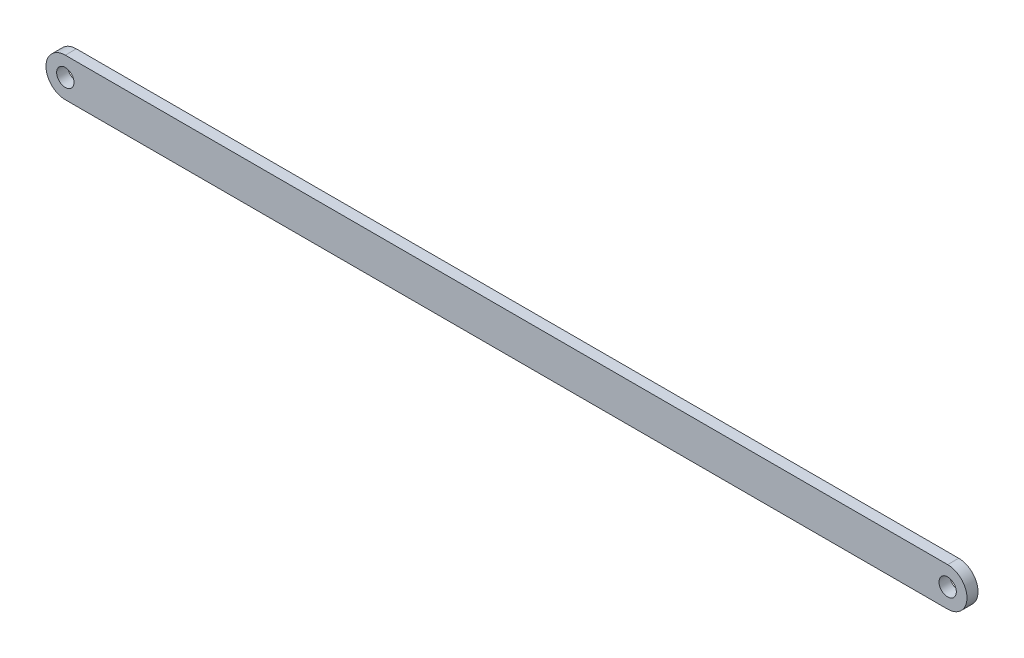
ISO-10303-21;
HEADER;
FILE_DESCRIPTION(('STEP AP214'),'2;1');
FILE_NAME('part.step','',(''),(''),'','','');
FILE_SCHEMA(('AUTOMOTIVE_DESIGN { 1 0 10303 214 1 1 1 1 }'));
ENDSEC;
DATA;
#1=APPLICATION_CONTEXT('core data for automotive mechanical design processes');
#2=APPLICATION_PROTOCOL_DEFINITION('international standard','automotive_design',2000,#1);
#3=PRODUCT_CONTEXT('',#1,'mechanical');
#4=PRODUCT('Part','Part','',(#3));
#5=PRODUCT_RELATED_PRODUCT_CATEGORY('part','',(#4));
#6=PRODUCT_DEFINITION_FORMATION('','',#4);
#7=PRODUCT_DEFINITION_CONTEXT('part definition',#1,'design');
#8=PRODUCT_DEFINITION('design','',#6,#7);
#9=PRODUCT_DEFINITION_SHAPE('','',#8);
#10=(LENGTH_UNIT() NAMED_UNIT(*) SI_UNIT(.MILLI.,.METRE.));
#11=(NAMED_UNIT(*) PLANE_ANGLE_UNIT() SI_UNIT($,.RADIAN.));
#12=(NAMED_UNIT(*) SI_UNIT($,.STERADIAN.) SOLID_ANGLE_UNIT());
#13=UNCERTAINTY_MEASURE_WITH_UNIT(LENGTH_MEASURE(1.E-05),#10,'distance_accuracy_value','');
#14=(GEOMETRIC_REPRESENTATION_CONTEXT(3) GLOBAL_UNCERTAINTY_ASSIGNED_CONTEXT((#13)) GLOBAL_UNIT_ASSIGNED_CONTEXT((#10,
#11,#12)) REPRESENTATION_CONTEXT('',''));
#15=CARTESIAN_POINT('',(0.,0.,0.));
#16=DIRECTION('',(0.,0.,1.));
#17=DIRECTION('',(1.,0.,0.));
#18=AXIS2_PLACEMENT_3D('',#15,#16,#17);
#19=CARTESIAN_POINT('',(-101.6,0.,2.54));
#20=DIRECTION('',(0.,0.,-1.));
#21=DIRECTION('',(-1.,0.,0.));
#22=AXIS2_PLACEMENT_3D('',#19,#20,#21);
#23=CYLINDRICAL_SURFACE('',#22,4.445);
#24=CARTESIAN_POINT('',(-101.6,0.,0.));
#25=DIRECTION('',(0.,0.,1.));
#26=DIRECTION('',(1.,0.,0.));
#27=AXIS2_PLACEMENT_3D('',#24,#25,#26);
#28=CIRCLE('',#27,4.445);
#29=CARTESIAN_POINT('',(-101.6,4.445,0.));
#30=VERTEX_POINT('',#29);
#31=CARTESIAN_POINT('',(-101.6,-4.445,0.));
#32=VERTEX_POINT('',#31);
#33=EDGE_CURVE('E109',#30,#32,#28,.T.);
#34=ORIENTED_EDGE('',*,*,#33,.T.);
#35=DIRECTION('',(0.,0.,-1.));
#36=VECTOR('',#35,1.);
#37=CARTESIAN_POINT('',(-101.6,-4.445,2.54));
#38=LINE('',#37,#36);
#39=CARTESIAN_POINT('',(-101.6,-4.445,2.54));
#40=VERTEX_POINT('',#39);
#41=EDGE_CURVE('E11',#40,#32,#38,.T.);
#42=ORIENTED_EDGE('',*,*,#41,.F.);
#43=CARTESIAN_POINT('',(-101.6,0.,2.54));
#44=DIRECTION('',(0.,0.,1.));
#45=DIRECTION('',(1.,0.,0.));
#46=AXIS2_PLACEMENT_3D('',#43,#44,#45);
#47=CIRCLE('',#46,4.445);
#48=CARTESIAN_POINT('',(-101.6,4.445,2.54));
#49=VERTEX_POINT('',#48);
#50=EDGE_CURVE('E89',#49,#40,#47,.T.);
#51=ORIENTED_EDGE('',*,*,#50,.F.);
#52=DIRECTION('',(0.,0.,-1.));
#53=VECTOR('',#52,1.);
#54=CARTESIAN_POINT('',(-101.6,4.445,2.54));
#55=LINE('',#54,#53);
#56=EDGE_CURVE('E55',#49,#30,#55,.T.);
#57=ORIENTED_EDGE('',*,*,#56,.T.);
#58=EDGE_LOOP('',(#34,#42,#51,#57));
#59=FACE_BOUND('',#58,.T.);
#60=ADVANCED_FACE('F38',(#59),#23,.T.);
#61=CARTESIAN_POINT('',(0.,-4.445,2.54));
#62=DIRECTION('',(0.,1.,0.));
#63=DIRECTION('',(0.,0.,1.));
#64=AXIS2_PLACEMENT_3D('',#61,#62,#63);
#65=PLANE('',#64);
#66=DIRECTION('',(1.,0.,0.));
#67=VECTOR('',#66,1.);
#68=CARTESIAN_POINT('',(0.,-4.445,0.));
#69=LINE('',#68,#67);
#70=CARTESIAN_POINT('',(101.6,-4.445,0.));
#71=VERTEX_POINT('',#70);
#72=EDGE_CURVE('E94',#32,#71,#69,.T.);
#73=ORIENTED_EDGE('',*,*,#72,.T.);
#74=DIRECTION('',(0.,0.,-1.));
#75=VECTOR('',#74,1.);
#76=CARTESIAN_POINT('',(101.6,-4.445,2.54));
#77=LINE('',#76,#75);
#78=CARTESIAN_POINT('',(101.6,-4.445,2.54));
#79=VERTEX_POINT('',#78);
#80=EDGE_CURVE('E47',#79,#71,#77,.T.);
#81=ORIENTED_EDGE('',*,*,#80,.F.);
#82=DIRECTION('',(1.,0.,0.));
#83=VECTOR('',#82,1.);
#84=CARTESIAN_POINT('',(0.,-4.445,2.54));
#85=LINE('',#84,#83);
#86=EDGE_CURVE('E81',#40,#79,#85,.T.);
#87=ORIENTED_EDGE('',*,*,#86,.F.);
#88=ORIENTED_EDGE('',*,*,#41,.T.);
#89=EDGE_LOOP('',(#73,#81,#87,#88));
#90=FACE_BOUND('',#89,.T.);
#91=ADVANCED_FACE('F93',(#90),#65,.F.);
#92=CARTESIAN_POINT('',(101.6,0.,2.54));
#93=DIRECTION('',(0.,0.,-1.));
#94=DIRECTION('',(-1.,0.,0.));
#95=AXIS2_PLACEMENT_3D('',#92,#93,#94);
#96=CYLINDRICAL_SURFACE('',#95,4.445);
#97=CARTESIAN_POINT('',(101.6,0.,0.));
#98=DIRECTION('',(0.,0.,1.));
#99=DIRECTION('',(1.,0.,0.));
#100=AXIS2_PLACEMENT_3D('',#97,#98,#99);
#101=CIRCLE('',#100,4.445);
#102=CARTESIAN_POINT('',(101.6,4.445,0.));
#103=VERTEX_POINT('',#102);
#104=EDGE_CURVE('E112',#71,#103,#101,.T.);
#105=ORIENTED_EDGE('',*,*,#104,.T.);
#106=DIRECTION('',(0.,0.,-1.));
#107=VECTOR('',#106,1.);
#108=CARTESIAN_POINT('',(101.6,4.445,2.54));
#109=LINE('',#108,#107);
#110=CARTESIAN_POINT('',(101.6,4.445,2.54));
#111=VERTEX_POINT('',#110);
#112=EDGE_CURVE('E70',#111,#103,#109,.T.);
#113=ORIENTED_EDGE('',*,*,#112,.F.);
#114=CARTESIAN_POINT('',(101.6,0.,2.54));
#115=DIRECTION('',(0.,0.,1.));
#116=DIRECTION('',(1.,0.,0.));
#117=AXIS2_PLACEMENT_3D('',#114,#115,#116);
#118=CIRCLE('',#117,4.445);
#119=EDGE_CURVE('E88',#79,#111,#118,.T.);
#120=ORIENTED_EDGE('',*,*,#119,.F.);
#121=ORIENTED_EDGE('',*,*,#80,.T.);
#122=EDGE_LOOP('',(#105,#113,#120,#121));
#123=FACE_BOUND('',#122,.T.);
#124=ADVANCED_FACE('F97',(#123),#96,.T.);
#125=CARTESIAN_POINT('',(0.,4.445,2.54));
#126=DIRECTION('',(0.,1.,0.));
#127=DIRECTION('',(0.,0.,1.));
#128=AXIS2_PLACEMENT_3D('',#125,#126,#127);
#129=PLANE('',#128);
#130=DIRECTION('',(1.,0.,0.));
#131=VECTOR('',#130,1.);
#132=CARTESIAN_POINT('',(0.,4.445,0.));
#133=LINE('',#132,#131);
#134=EDGE_CURVE('E114',#30,#103,#133,.T.);
#135=ORIENTED_EDGE('',*,*,#134,.F.);
#136=ORIENTED_EDGE('',*,*,#56,.F.);
#137=DIRECTION('',(1.,0.,0.));
#138=VECTOR('',#137,1.);
#139=CARTESIAN_POINT('',(0.,4.445,2.54));
#140=LINE('',#139,#138);
#141=EDGE_CURVE('E98',#49,#111,#140,.T.);
#142=ORIENTED_EDGE('',*,*,#141,.T.);
#143=ORIENTED_EDGE('',*,*,#112,.T.);
#144=EDGE_LOOP('',(#135,#136,#142,#143));
#145=FACE_BOUND('',#144,.T.);
#146=ADVANCED_FACE('F150',(#145),#129,.T.);
#147=CARTESIAN_POINT('',(101.6,0.,2.54));
#148=DIRECTION('',(0.,0.,-1.));
#149=DIRECTION('',(-1.,0.,0.));
#150=AXIS2_PLACEMENT_3D('',#147,#148,#149);
#151=CYLINDRICAL_SURFACE('',#150,1.99389999999999);
#152=CARTESIAN_POINT('',(101.6,0.,2.54));
#153=DIRECTION('',(0.,0.,1.));
#154=DIRECTION('',(1.,0.,0.));
#155=AXIS2_PLACEMENT_3D('',#152,#153,#154);
#156=CIRCLE('',#155,1.99389999999999);
#157=CARTESIAN_POINT('',(103.5939,0.,2.54));
#158=VERTEX_POINT('',#157);
#159=EDGE_CURVE('E120',#158,#158,#156,.T.);
#160=ORIENTED_EDGE('',*,*,#159,.T.);
#161=EDGE_LOOP('',(#160));
#162=FACE_BOUND('',#161,.T.);
#163=CARTESIAN_POINT('',(101.6,0.,0.));
#164=DIRECTION('',(0.,0.,1.));
#165=DIRECTION('',(1.,0.,0.));
#166=AXIS2_PLACEMENT_3D('',#163,#164,#165);
#167=CIRCLE('',#166,1.99389999999999);
#168=CARTESIAN_POINT('',(103.5939,0.,0.));
#169=VERTEX_POINT('',#168);
#170=EDGE_CURVE('E106',#169,#169,#167,.T.);
#171=ORIENTED_EDGE('',*,*,#170,.F.);
#172=EDGE_LOOP('',(#171));
#173=FACE_BOUND('',#172,.T.);
#174=ADVANCED_FACE('F40',(#162,#173),#151,.F.);
#175=CARTESIAN_POINT('',(-101.6,0.,2.54));
#176=DIRECTION('',(0.,0.,-1.));
#177=DIRECTION('',(-1.,0.,0.));
#178=AXIS2_PLACEMENT_3D('',#175,#176,#177);
#179=CYLINDRICAL_SURFACE('',#178,1.99389999999999);
#180=CARTESIAN_POINT('',(-101.6,0.,2.54));
#181=DIRECTION('',(0.,0.,1.));
#182=DIRECTION('',(1.,0.,0.));
#183=AXIS2_PLACEMENT_3D('',#180,#181,#182);
#184=CIRCLE('',#183,1.99389999999999);
#185=CARTESIAN_POINT('',(-99.6061,0.,2.54));
#186=VERTEX_POINT('',#185);
#187=EDGE_CURVE('E100',#186,#186,#184,.T.);
#188=ORIENTED_EDGE('',*,*,#187,.T.);
#189=EDGE_LOOP('',(#188));
#190=FACE_BOUND('',#189,.T.);
#191=CARTESIAN_POINT('',(-101.6,0.,0.));
#192=DIRECTION('',(0.,0.,1.));
#193=DIRECTION('',(1.,0.,0.));
#194=AXIS2_PLACEMENT_3D('',#191,#192,#193);
#195=CIRCLE('',#194,1.99389999999999);
#196=CARTESIAN_POINT('',(-99.6061,0.,0.));
#197=VERTEX_POINT('',#196);
#198=EDGE_CURVE('E117',#197,#197,#195,.T.);
#199=ORIENTED_EDGE('',*,*,#198,.F.);
#200=EDGE_LOOP('',(#199));
#201=FACE_BOUND('',#200,.T.);
#202=ADVANCED_FACE('F132',(#190,#201),#179,.F.);
#203=CARTESIAN_POINT('',(0.,0.,2.54));
#204=DIRECTION('',(0.,0.,1.));
#205=DIRECTION('',(1.,0.,0.));
#206=AXIS2_PLACEMENT_3D('',#203,#204,#205);
#207=PLANE('',#206);
#208=ORIENTED_EDGE('',*,*,#159,.F.);
#209=EDGE_LOOP('',(#208));
#210=FACE_BOUND('',#209,.T.);
#211=ORIENTED_EDGE('',*,*,#50,.T.);
#212=ORIENTED_EDGE('',*,*,#86,.T.);
#213=ORIENTED_EDGE('',*,*,#119,.T.);
#214=ORIENTED_EDGE('',*,*,#141,.F.);
#215=EDGE_LOOP('',(#211,#212,#213,#214));
#216=FACE_BOUND('',#215,.T.);
#217=ORIENTED_EDGE('',*,*,#187,.F.);
#218=EDGE_LOOP('',(#217));
#219=FACE_BOUND('',#218,.T.);
#220=ADVANCED_FACE('F84',(#210,#216,#219),#207,.T.);
#221=CARTESIAN_POINT('',(0.,0.,0.));
#222=DIRECTION('',(0.,0.,1.));
#223=DIRECTION('',(1.,0.,0.));
#224=AXIS2_PLACEMENT_3D('',#221,#222,#223);
#225=PLANE('',#224);
#226=ORIENTED_EDGE('',*,*,#170,.T.);
#227=EDGE_LOOP('',(#226));
#228=FACE_BOUND('',#227,.T.);
#229=ORIENTED_EDGE('',*,*,#33,.F.);
#230=ORIENTED_EDGE('',*,*,#134,.T.);
#231=ORIENTED_EDGE('',*,*,#104,.F.);
#232=ORIENTED_EDGE('',*,*,#72,.F.);
#233=EDGE_LOOP('',(#229,#230,#231,#232));
#234=FACE_BOUND('',#233,.T.);
#235=ORIENTED_EDGE('',*,*,#198,.T.);
#236=EDGE_LOOP('',(#235));
#237=FACE_BOUND('',#236,.T.);
#238=ADVANCED_FACE('F131',(#228,#234,#237),#225,.F.);
#239=CLOSED_SHELL('',(#60,#91,#124,#146,#174,#202,#220,#238));
#240=MANIFOLD_SOLID_BREP('B2',#239);
#241=ADVANCED_BREP_SHAPE_REPRESENTATION('',(#18,#240),#14);
#242=SHAPE_DEFINITION_REPRESENTATION(#9,#241);
ENDSEC;
END-ISO-10303-21;
